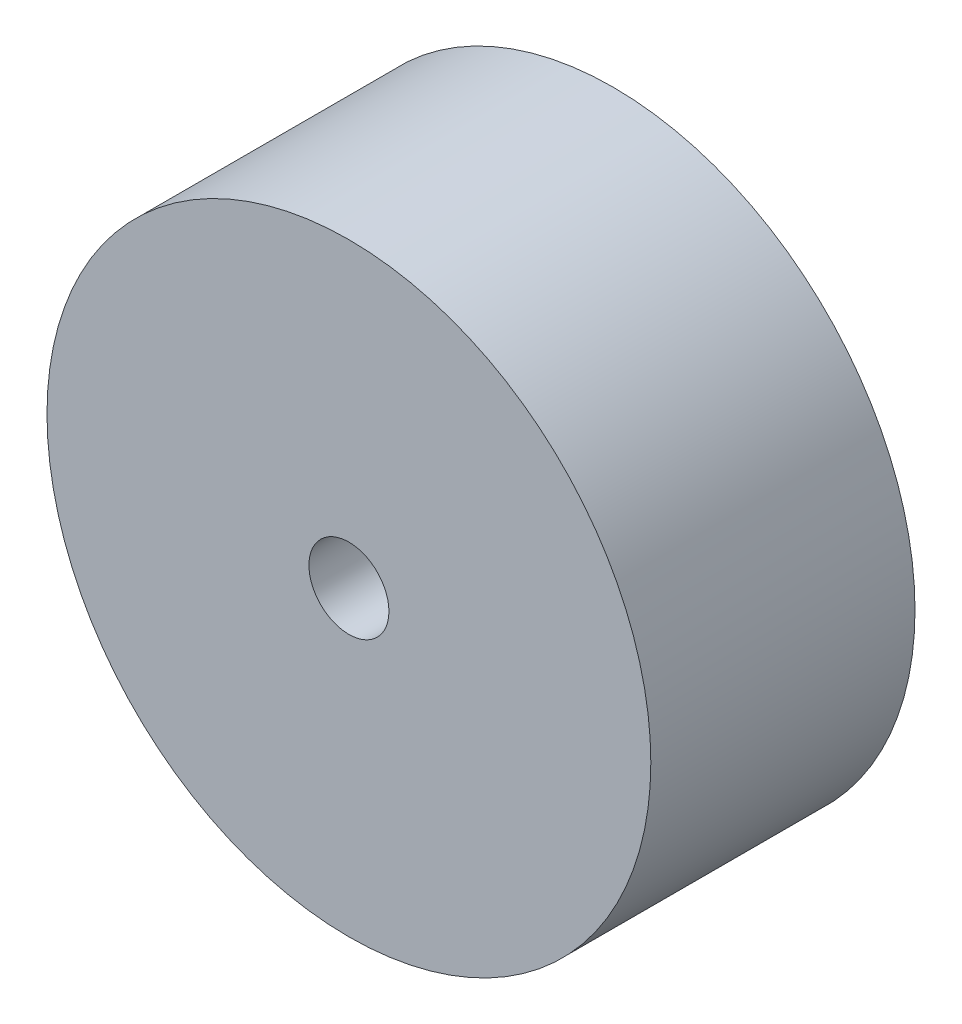
ISO-10303-21;
HEADER;
FILE_DESCRIPTION(('STEP AP214'),'2;1');
FILE_NAME('part.step','',(''),(''),'','','');
FILE_SCHEMA(('AUTOMOTIVE_DESIGN { 1 0 10303 214 1 1 1 1 }'));
ENDSEC;
DATA;
#1=APPLICATION_CONTEXT('core data for automotive mechanical design processes');
#2=APPLICATION_PROTOCOL_DEFINITION('international standard','automotive_design',2000,#1);
#3=PRODUCT_CONTEXT('',#1,'mechanical');
#4=PRODUCT('Part','Part','',(#3));
#5=PRODUCT_RELATED_PRODUCT_CATEGORY('part','',(#4));
#6=PRODUCT_DEFINITION_FORMATION('','',#4);
#7=PRODUCT_DEFINITION_CONTEXT('part definition',#1,'design');
#8=PRODUCT_DEFINITION('design','',#6,#7);
#9=PRODUCT_DEFINITION_SHAPE('','',#8);
#10=(LENGTH_UNIT() NAMED_UNIT(*) SI_UNIT(.MILLI.,.METRE.));
#11=(NAMED_UNIT(*) PLANE_ANGLE_UNIT() SI_UNIT($,.RADIAN.));
#12=(NAMED_UNIT(*) SI_UNIT($,.STERADIAN.) SOLID_ANGLE_UNIT());
#13=UNCERTAINTY_MEASURE_WITH_UNIT(LENGTH_MEASURE(1.E-05),#10,'distance_accuracy_value','');
#14=(GEOMETRIC_REPRESENTATION_CONTEXT(3) GLOBAL_UNCERTAINTY_ASSIGNED_CONTEXT((#13)) GLOBAL_UNIT_ASSIGNED_CONTEXT((#10,
#11,#12)) REPRESENTATION_CONTEXT('',''));
#15=CARTESIAN_POINT('',(0.,0.,0.));
#16=DIRECTION('',(0.,0.,1.));
#17=DIRECTION('',(1.,0.,0.));
#18=AXIS2_PLACEMENT_3D('',#15,#16,#17);
#19=CARTESIAN_POINT('',(0.,0.,22.225));
#20=DIRECTION('',(0.,0.,-1.));
#21=DIRECTION('',(-1.,0.,0.));
#22=AXIS2_PLACEMENT_3D('',#19,#20,#21);
#23=CYLINDRICAL_SURFACE('',#22,25.4);
#24=CARTESIAN_POINT('',(0.,0.,22.225));
#25=DIRECTION('',(0.,0.,1.));
#26=DIRECTION('',(1.,0.,0.));
#27=AXIS2_PLACEMENT_3D('',#24,#25,#26);
#28=CIRCLE('',#27,25.4);
#29=CARTESIAN_POINT('',(25.4,0.,22.225));
#30=VERTEX_POINT('',#29);
#31=EDGE_CURVE('E10',#30,#30,#28,.T.);
#32=ORIENTED_EDGE('',*,*,#31,.F.);
#33=EDGE_LOOP('',(#32));
#34=FACE_BOUND('',#33,.T.);
#35=CARTESIAN_POINT('',(0.,0.,0.));
#36=DIRECTION('',(0.,0.,1.));
#37=DIRECTION('',(1.,0.,0.));
#38=AXIS2_PLACEMENT_3D('',#35,#36,#37);
#39=CIRCLE('',#38,25.4);
#40=CARTESIAN_POINT('',(25.4,0.,0.));
#41=VERTEX_POINT('',#40);
#42=EDGE_CURVE('E34',#41,#41,#39,.T.);
#43=ORIENTED_EDGE('',*,*,#42,.T.);
#44=EDGE_LOOP('',(#43));
#45=FACE_BOUND('',#44,.T.);
#46=ADVANCED_FACE('F31',(#34,#45),#23,.T.);
#47=CARTESIAN_POINT('',(0.,0.,22.225));
#48=DIRECTION('',(0.,0.,1.));
#49=DIRECTION('',(1.,0.,0.));
#50=AXIS2_PLACEMENT_3D('',#47,#48,#49);
#51=PLANE('',#50);
#52=CARTESIAN_POINT('',(0.,0.,22.225));
#53=DIRECTION('',(0.,0.,1.));
#54=DIRECTION('',(1.,0.,0.));
#55=AXIS2_PLACEMENT_3D('',#52,#53,#54);
#56=CIRCLE('',#55,3.3655);
#57=CARTESIAN_POINT('',(3.3655,0.,22.225));
#58=VERTEX_POINT('',#57);
#59=EDGE_CURVE('E43',#58,#58,#56,.T.);
#60=ORIENTED_EDGE('',*,*,#59,.F.);
#61=EDGE_LOOP('',(#60));
#62=FACE_BOUND('',#61,.T.);
#63=ORIENTED_EDGE('',*,*,#31,.T.);
#64=EDGE_LOOP('',(#63));
#65=FACE_BOUND('',#64,.T.);
#66=ADVANCED_FACE('F58',(#62,#65),#51,.T.);
#67=CARTESIAN_POINT('',(0.,0.,0.));
#68=DIRECTION('',(0.,0.,1.));
#69=DIRECTION('',(1.,0.,0.));
#70=AXIS2_PLACEMENT_3D('',#67,#68,#69);
#71=PLANE('',#70);
#72=CARTESIAN_POINT('',(0.,0.,0.));
#73=DIRECTION('',(0.,0.,1.));
#74=DIRECTION('',(1.,0.,0.));
#75=AXIS2_PLACEMENT_3D('',#72,#73,#74);
#76=CIRCLE('',#75,3.3655);
#77=CARTESIAN_POINT('',(3.3655,0.,0.));
#78=VERTEX_POINT('',#77);
#79=EDGE_CURVE('E41',#78,#78,#76,.T.);
#80=ORIENTED_EDGE('',*,*,#79,.T.);
#81=EDGE_LOOP('',(#80));
#82=FACE_BOUND('',#81,.T.);
#83=ORIENTED_EDGE('',*,*,#42,.F.);
#84=EDGE_LOOP('',(#83));
#85=FACE_BOUND('',#84,.T.);
#86=ADVANCED_FACE('F49',(#82,#85),#71,.F.);
#87=CARTESIAN_POINT('',(0.,0.,0.));
#88=DIRECTION('',(0.,0.,1.));
#89=DIRECTION('',(1.,0.,0.));
#90=AXIS2_PLACEMENT_3D('',#87,#88,#89);
#91=CYLINDRICAL_SURFACE('',#90,3.3655);
#92=ORIENTED_EDGE('',*,*,#79,.F.);
#93=EDGE_LOOP('',(#92));
#94=FACE_BOUND('',#93,.T.);
#95=ORIENTED_EDGE('',*,*,#59,.T.);
#96=EDGE_LOOP('',(#95));
#97=FACE_BOUND('',#96,.T.);
#98=ADVANCED_FACE('F52',(#94,#97),#91,.F.);
#99=CLOSED_SHELL('',(#46,#66,#86,#98));
#100=MANIFOLD_SOLID_BREP('B2',#99);
#101=ADVANCED_BREP_SHAPE_REPRESENTATION('',(#18,#100),#14);
#102=SHAPE_DEFINITION_REPRESENTATION(#9,#101);
ENDSEC;
END-ISO-10303-21;
